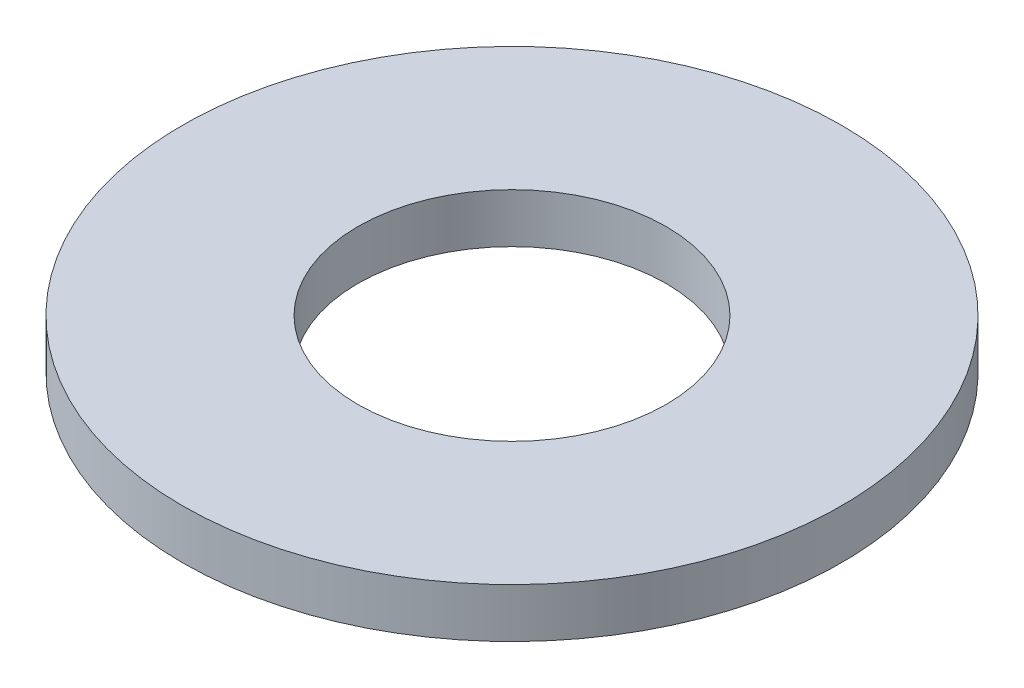
ISO-10303-21;
HEADER;
FILE_DESCRIPTION(('STEP AP214'),'2;1');
FILE_NAME('part.step','',(''),(''),'','','');
FILE_SCHEMA(('AUTOMOTIVE_DESIGN { 1 0 10303 214 1 1 1 1 }'));
ENDSEC;
DATA;
#1=APPLICATION_CONTEXT('core data for automotive mechanical design processes');
#2=APPLICATION_PROTOCOL_DEFINITION('international standard','automotive_design',2000,#1);
#3=PRODUCT_CONTEXT('',#1,'mechanical');
#4=PRODUCT('Part','Part','',(#3));
#5=PRODUCT_RELATED_PRODUCT_CATEGORY('part','',(#4));
#6=PRODUCT_DEFINITION_FORMATION('','',#4);
#7=PRODUCT_DEFINITION_CONTEXT('part definition',#1,'design');
#8=PRODUCT_DEFINITION('design','',#6,#7);
#9=PRODUCT_DEFINITION_SHAPE('','',#8);
#10=(LENGTH_UNIT() NAMED_UNIT(*) SI_UNIT(.MILLI.,.METRE.));
#11=(NAMED_UNIT(*) PLANE_ANGLE_UNIT() SI_UNIT($,.RADIAN.));
#12=(NAMED_UNIT(*) SI_UNIT($,.STERADIAN.) SOLID_ANGLE_UNIT());
#13=UNCERTAINTY_MEASURE_WITH_UNIT(LENGTH_MEASURE(1.E-05),#10,'distance_accuracy_value','');
#14=(GEOMETRIC_REPRESENTATION_CONTEXT(3) GLOBAL_UNCERTAINTY_ASSIGNED_CONTEXT((#13)) GLOBAL_UNIT_ASSIGNED_CONTEXT((#10,
#11,#12)) REPRESENTATION_CONTEXT('',''));
#15=CARTESIAN_POINT('',(0.,0.,0.));
#16=DIRECTION('',(0.,0.,1.));
#17=DIRECTION('',(1.,0.,0.));
#18=AXIS2_PLACEMENT_3D('',#15,#16,#17);
#19=CARTESIAN_POINT('',(0.,0.8255,0.));
#20=DIRECTION('',(0.,1.,0.));
#21=DIRECTION('',(0.,0.,1.));
#22=AXIS2_PLACEMENT_3D('',#19,#20,#21);
#23=PLANE('',#22);
#24=CARTESIAN_POINT('',(0.,0.8255,0.));
#25=DIRECTION('',(0.,1.,0.));
#26=DIRECTION('',(0.,0.,1.));
#27=AXIS2_PLACEMENT_3D('',#24,#25,#26);
#28=CIRCLE('',#27,5.5118);
#29=CARTESIAN_POINT('',(0.,0.8255,5.5118));
#30=VERTEX_POINT('',#29);
#31=EDGE_CURVE('E10',#30,#30,#28,.T.);
#32=ORIENTED_EDGE('',*,*,#31,.T.);
#33=EDGE_LOOP('',(#32));
#34=FACE_BOUND('',#33,.T.);
#35=CARTESIAN_POINT('',(0.,0.8255,0.));
#36=DIRECTION('',(0.,1.,0.));
#37=DIRECTION('',(0.,0.,1.));
#38=AXIS2_PLACEMENT_3D('',#35,#36,#37);
#39=CIRCLE('',#38,2.5781);
#40=CARTESIAN_POINT('',(0.,0.8255,2.5781));
#41=VERTEX_POINT('',#40);
#42=EDGE_CURVE('E44',#41,#41,#39,.T.);
#43=ORIENTED_EDGE('',*,*,#42,.F.);
#44=EDGE_LOOP('',(#43));
#45=FACE_BOUND('',#44,.T.);
#46=ADVANCED_FACE('F33',(#34,#45),#23,.T.);
#47=CARTESIAN_POINT('',(0.,0.,0.));
#48=DIRECTION('',(0.,1.,0.));
#49=DIRECTION('',(0.,0.,1.));
#50=AXIS2_PLACEMENT_3D('',#47,#48,#49);
#51=PLANE('',#50);
#52=CARTESIAN_POINT('',(0.,0.,0.));
#53=DIRECTION('',(0.,1.,0.));
#54=DIRECTION('',(0.,0.,1.));
#55=AXIS2_PLACEMENT_3D('',#52,#53,#54);
#56=CIRCLE('',#55,5.5118);
#57=CARTESIAN_POINT('',(0.,0.,5.5118));
#58=VERTEX_POINT('',#57);
#59=EDGE_CURVE('E37',#58,#58,#56,.T.);
#60=ORIENTED_EDGE('',*,*,#59,.F.);
#61=EDGE_LOOP('',(#60));
#62=FACE_BOUND('',#61,.T.);
#63=CARTESIAN_POINT('',(0.,0.,0.));
#64=DIRECTION('',(0.,1.,0.));
#65=DIRECTION('',(0.,0.,1.));
#66=AXIS2_PLACEMENT_3D('',#63,#64,#65);
#67=CIRCLE('',#66,2.5781);
#68=CARTESIAN_POINT('',(0.,0.,2.5781));
#69=VERTEX_POINT('',#68);
#70=EDGE_CURVE('E46',#69,#69,#67,.T.);
#71=ORIENTED_EDGE('',*,*,#70,.T.);
#72=EDGE_LOOP('',(#71));
#73=FACE_BOUND('',#72,.T.);
#74=ADVANCED_FACE('F56',(#62,#73),#51,.F.);
#75=CARTESIAN_POINT('',(0.,0.8255,0.));
#76=DIRECTION('',(0.,-1.,0.));
#77=DIRECTION('',(0.,0.,-1.));
#78=AXIS2_PLACEMENT_3D('',#75,#76,#77);
#79=CYLINDRICAL_SURFACE('',#78,5.5118);
#80=ORIENTED_EDGE('',*,*,#31,.F.);
#81=EDGE_LOOP('',(#80));
#82=FACE_BOUND('',#81,.T.);
#83=ORIENTED_EDGE('',*,*,#59,.T.);
#84=EDGE_LOOP('',(#83));
#85=FACE_BOUND('',#84,.T.);
#86=ADVANCED_FACE('F35',(#82,#85),#79,.T.);
#87=CARTESIAN_POINT('',(0.,0.8255,0.));
#88=DIRECTION('',(0.,-1.,0.));
#89=DIRECTION('',(0.,0.,-1.));
#90=AXIS2_PLACEMENT_3D('',#87,#88,#89);
#91=CYLINDRICAL_SURFACE('',#90,2.5781);
#92=ORIENTED_EDGE('',*,*,#42,.T.);
#93=EDGE_LOOP('',(#92));
#94=FACE_BOUND('',#93,.T.);
#95=ORIENTED_EDGE('',*,*,#70,.F.);
#96=EDGE_LOOP('',(#95));
#97=FACE_BOUND('',#96,.T.);
#98=ADVANCED_FACE('F52',(#94,#97),#91,.F.);
#99=CLOSED_SHELL('',(#46,#74,#86,#98));
#100=MANIFOLD_SOLID_BREP('B2',#99);
#101=ADVANCED_BREP_SHAPE_REPRESENTATION('',(#18,#100),#14);
#102=SHAPE_DEFINITION_REPRESENTATION(#9,#101);
ENDSEC;
END-ISO-10303-21;
